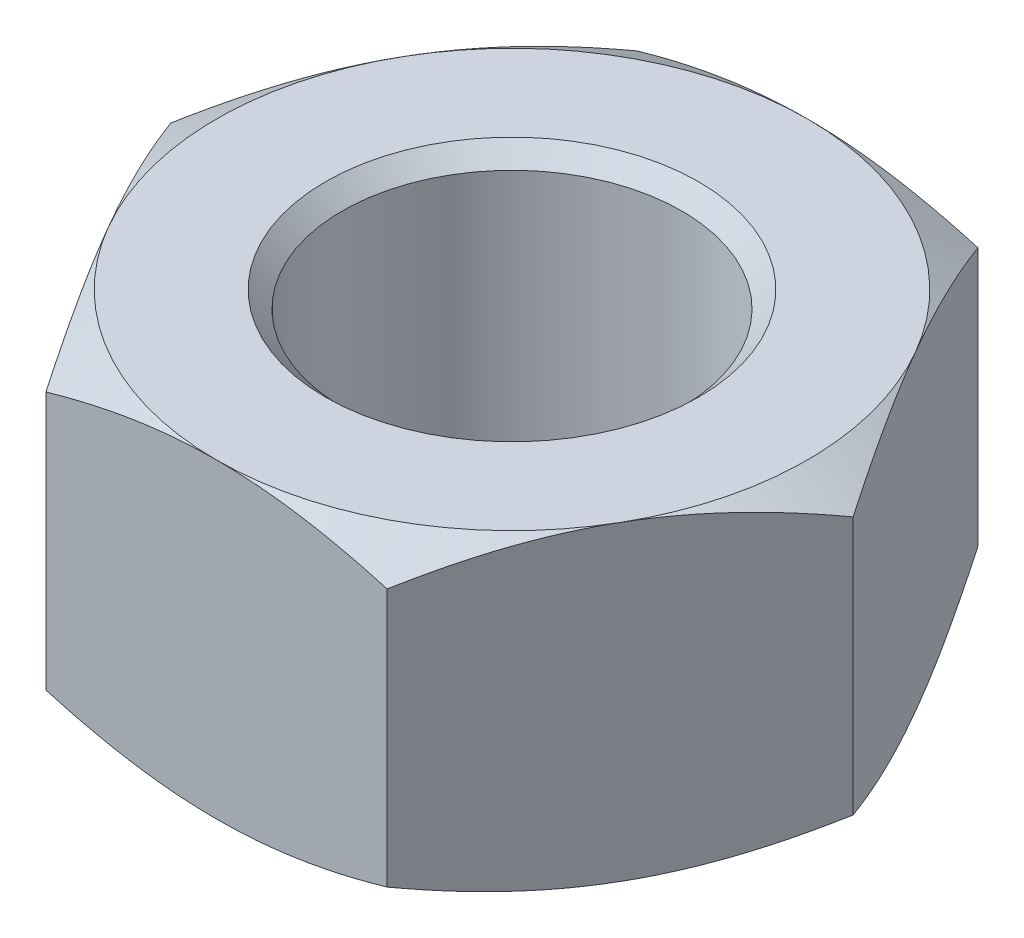
ISO-10303-21;
HEADER;
FILE_DESCRIPTION(('STEP AP214'),'2;1');
FILE_NAME('part.step','',(''),(''),'','','');
FILE_SCHEMA(('AUTOMOTIVE_DESIGN { 1 0 10303 214 1 1 1 1 }'));
ENDSEC;
DATA;
#1=APPLICATION_CONTEXT('core data for automotive mechanical design processes');
#2=APPLICATION_PROTOCOL_DEFINITION('international standard','automotive_design',2000,#1);
#3=PRODUCT_CONTEXT('',#1,'mechanical');
#4=PRODUCT('Part','Part','',(#3));
#5=PRODUCT_RELATED_PRODUCT_CATEGORY('part','',(#4));
#6=PRODUCT_DEFINITION_FORMATION('','',#4);
#7=PRODUCT_DEFINITION_CONTEXT('part definition',#1,'design');
#8=PRODUCT_DEFINITION('design','',#6,#7);
#9=PRODUCT_DEFINITION_SHAPE('','',#8);
#10=(LENGTH_UNIT() NAMED_UNIT(*) SI_UNIT(.MILLI.,.METRE.));
#11=(NAMED_UNIT(*) PLANE_ANGLE_UNIT() SI_UNIT($,.RADIAN.));
#12=(NAMED_UNIT(*) SI_UNIT($,.STERADIAN.) SOLID_ANGLE_UNIT());
#13=UNCERTAINTY_MEASURE_WITH_UNIT(LENGTH_MEASURE(1.E-05),#10,'distance_accuracy_value','');
#14=(GEOMETRIC_REPRESENTATION_CONTEXT(3) GLOBAL_UNCERTAINTY_ASSIGNED_CONTEXT((#13)) GLOBAL_UNIT_ASSIGNED_CONTEXT((#10,
#11,#12)) REPRESENTATION_CONTEXT('',''));
#15=CARTESIAN_POINT('',(0.,0.,0.));
#16=DIRECTION('',(0.,0.,1.));
#17=DIRECTION('',(1.,0.,0.));
#18=AXIS2_PLACEMENT_3D('',#15,#16,#17);
#19=CARTESIAN_POINT('',(-38.7727586640478,-69.,-4.75));
#20=DIRECTION('',(0.866025403784439,0.,-0.5));
#21=DIRECTION('',(-0.5,0.,-0.866025403784439));
#22=AXIS2_PLACEMENT_3D('',#19,#20,#21);
#23=PLANE('',#22);
#24=CARTESIAN_POINT('',(-41.5180162225476,-67.1498517286183,-9.50492557118405));
#25=CARTESIAN_POINT('',(-40.0466600833053,-68.,-6.95646198198795));
#26=CARTESIAN_POINT('',(-38.7727586640478,-68.,-4.75));
#27=CARTESIAN_POINT('',(-37.4988572447905,-68.0000000000001,-2.54353801801205));
#28=CARTESIAN_POINT('',(-36.0275011055481,-67.1498517286183,0.00492557118405202));
#29=(BOUNDED_CURVE() B_SPLINE_CURVE(2,(#24,#25,#26,#27,#28),.UNSPECIFIED.,.F.,
.F.) B_SPLINE_CURVE_WITH_KNOTS((3,2,3),(0.,5.57015057763849,11.140301155277),
.UNSPECIFIED.) CURVE() GEOMETRIC_REPRESENTATION_ITEM() RATIONAL_B_SPLINE_CURVE((1.,
1.03802697460132,1.,1.03802697460132,1.)) REPRESENTATION_ITEM(''));
#30=CARTESIAN_POINT('',(-41.5151724426986,-67.1514942239681,-9.5));
#31=VERTEX_POINT('',#30);
#32=CARTESIAN_POINT('',(-38.7727586640478,-68.,-4.75));
#33=VERTEX_POINT('',#32);
#34=EDGE_CURVE('E137',#31,#33,#29,.T.);
#35=ORIENTED_EDGE('',*,*,#34,.F.);
#36=DIRECTION('',(0.,1.,0.));
#37=VECTOR('',#36,1.);
#38=CARTESIAN_POINT('',(-41.5151724426986,-69.,-9.5));
#39=LINE('',#38,#37);
#40=CARTESIAN_POINT('',(-41.5151724426986,-58.8485057760319,-9.5));
#41=VERTEX_POINT('',#40);
#42=EDGE_CURVE('E10',#31,#41,#39,.T.);
#43=ORIENTED_EDGE('',*,*,#42,.T.);
#44=CARTESIAN_POINT('',(-36.0275011055481,-58.8501482713817,0.00492557118405869));
#45=CARTESIAN_POINT('',(-37.4988572447904,-58.,-2.54353801801204));
#46=CARTESIAN_POINT('',(-38.7727586640478,-58.,-4.75));
#47=CARTESIAN_POINT('',(-40.0466600833052,-58.,-6.95646198198795));
#48=CARTESIAN_POINT('',(-41.5180162225476,-58.8501482713817,-9.50492557118406));
#49=(BOUNDED_CURVE() B_SPLINE_CURVE(2,(#44,#45,#46,#47,#48),.UNSPECIFIED.,.F.,
.F.) B_SPLINE_CURVE_WITH_KNOTS((3,2,3),(0.,5.57015057763849,11.140301155277),
.UNSPECIFIED.) CURVE() GEOMETRIC_REPRESENTATION_ITEM() RATIONAL_B_SPLINE_CURVE((1.,
1.03802697460132,1.,1.03802697460132,1.)) REPRESENTATION_ITEM(''));
#50=CARTESIAN_POINT('',(-38.7727586640478,-58.,-4.75));
#51=VERTEX_POINT('',#50);
#52=EDGE_CURVE('E166',#51,#41,#49,.T.);
#53=ORIENTED_EDGE('',*,*,#52,.F.);
#54=CARTESIAN_POINT('',(-36.0275011055481,-58.8501482713817,0.00492557118405869));
#55=CARTESIAN_POINT('',(-37.4988572447904,-58.,-2.54353801801204));
#56=CARTESIAN_POINT('',(-38.7727586640478,-58.,-4.75));
#57=CARTESIAN_POINT('',(-40.0466600833052,-58.,-6.95646198198795));
#58=CARTESIAN_POINT('',(-41.5180162225476,-58.8501482713817,-9.50492557118406));
#59=(BOUNDED_CURVE() B_SPLINE_CURVE(2,(#54,#55,#56,#57,#58),.UNSPECIFIED.,.F.,
.F.) B_SPLINE_CURVE_WITH_KNOTS((3,2,3),(0.,5.57015057763849,11.140301155277),
.UNSPECIFIED.) CURVE() GEOMETRIC_REPRESENTATION_ITEM() RATIONAL_B_SPLINE_CURVE((1.,
1.03802697460132,1.,1.03802697460132,1.)) REPRESENTATION_ITEM(''));
#60=CARTESIAN_POINT('',(-36.0303448853971,-58.8485057760319,0.));
#61=VERTEX_POINT('',#60);
#62=EDGE_CURVE('E212',#61,#51,#59,.T.);
#63=ORIENTED_EDGE('',*,*,#62,.F.);
#64=DIRECTION('',(0.,1.,0.));
#65=VECTOR('',#64,1.);
#66=CARTESIAN_POINT('',(-36.0303448853971,-69.,0.));
#67=LINE('',#66,#65);
#68=CARTESIAN_POINT('',(-36.0303448853971,-67.1514942239681,0.));
#69=VERTEX_POINT('',#68);
#70=EDGE_CURVE('E231',#69,#61,#67,.T.);
#71=ORIENTED_EDGE('',*,*,#70,.F.);
#72=CARTESIAN_POINT('',(-41.5180162225476,-67.1498517286183,-9.50492557118405));
#73=CARTESIAN_POINT('',(-40.0466600833053,-68.,-6.95646198198795));
#74=CARTESIAN_POINT('',(-38.7727586640478,-68.,-4.75));
#75=CARTESIAN_POINT('',(-37.4988572447905,-68.0000000000001,-2.54353801801205));
#76=CARTESIAN_POINT('',(-36.0275011055481,-67.1498517286183,0.00492557118405202));
#77=(BOUNDED_CURVE() B_SPLINE_CURVE(2,(#72,#73,#74,#75,#76),.UNSPECIFIED.,.F.,
.F.) B_SPLINE_CURVE_WITH_KNOTS((3,2,3),(0.,5.57015057763849,11.140301155277),
.UNSPECIFIED.) CURVE() GEOMETRIC_REPRESENTATION_ITEM() RATIONAL_B_SPLINE_CURVE((1.,
1.03802697460132,1.,1.03802697460132,1.)) REPRESENTATION_ITEM(''));
#78=EDGE_CURVE('E136',#33,#69,#77,.T.);
#79=ORIENTED_EDGE('',*,*,#78,.F.);
#80=EDGE_LOOP('',(#35,#43,#53,#63,#71,#79));
#81=FACE_BOUND('',#80,.T.);
#82=ADVANCED_FACE('F15',(#81),#23,.T.);
#83=CARTESIAN_POINT('',(-47.,-69.,-9.5));
#84=DIRECTION('',(0.,0.,-1.));
#85=DIRECTION('',(-1.,0.,0.));
#86=AXIS2_PLACEMENT_3D('',#83,#84,#85);
#87=PLANE('',#86);
#88=CARTESIAN_POINT('',(-52.4905151169995,-67.1498517286183,-9.5));
#89=CARTESIAN_POINT('',(-49.5478028385149,-68.0000000000001,-9.50000000000001));
#90=CARTESIAN_POINT('',(-47.,-68.,-9.5));
#91=CARTESIAN_POINT('',(-44.4521971614852,-68.0000000000001,-9.50000000000001));
#92=CARTESIAN_POINT('',(-41.5094848830005,-67.1498517286183,-9.5));
#93=(BOUNDED_CURVE() B_SPLINE_CURVE(2,(#88,#89,#90,#91,#92),.UNSPECIFIED.,.F.,
.F.) B_SPLINE_CURVE_WITH_KNOTS((3,2,3),(0.,5.57015057763849,11.140301155277),
.UNSPECIFIED.) CURVE() GEOMETRIC_REPRESENTATION_ITEM() RATIONAL_B_SPLINE_CURVE((1.,
1.03802697460134,1.,1.03802697460134,1.)) REPRESENTATION_ITEM(''));
#94=CARTESIAN_POINT('',(-52.4848275573015,-67.1514942239681,-9.5));
#95=VERTEX_POINT('',#94);
#96=CARTESIAN_POINT('',(-47.,-68.,-9.5));
#97=VERTEX_POINT('',#96);
#98=EDGE_CURVE('E173',#95,#97,#93,.T.);
#99=ORIENTED_EDGE('',*,*,#98,.F.);
#100=DIRECTION('',(0.,1.,0.));
#101=VECTOR('',#100,1.);
#102=CARTESIAN_POINT('',(-52.4848275573015,-69.,-9.5));
#103=LINE('',#102,#101);
#104=CARTESIAN_POINT('',(-52.4848275573015,-58.8485057760319,-9.5));
#105=VERTEX_POINT('',#104);
#106=EDGE_CURVE('E27',#95,#105,#103,.T.);
#107=ORIENTED_EDGE('',*,*,#106,.T.);
#108=CARTESIAN_POINT('',(-41.5094848830005,-58.8501482713817,-9.5));
#109=CARTESIAN_POINT('',(-44.4521971614851,-58.,-9.50000000000001));
#110=CARTESIAN_POINT('',(-47.,-58.,-9.5));
#111=CARTESIAN_POINT('',(-49.5478028385149,-58.,-9.50000000000001));
#112=CARTESIAN_POINT('',(-52.4905151169995,-58.8501482713817,-9.5));
#113=(BOUNDED_CURVE() B_SPLINE_CURVE(2,(#108,#109,#110,#111,#112),.UNSPECIFIED.,.F.,
.F.) B_SPLINE_CURVE_WITH_KNOTS((3,2,3),(0.,5.5701505776385,11.140301155277),
.UNSPECIFIED.) CURVE() GEOMETRIC_REPRESENTATION_ITEM() RATIONAL_B_SPLINE_CURVE((1.,
1.03802697460132,1.,1.03802697460132,1.)) REPRESENTATION_ITEM(''));
#114=CARTESIAN_POINT('',(-47.,-58.,-9.5));
#115=VERTEX_POINT('',#114);
#116=EDGE_CURVE('E138',#115,#105,#113,.T.);
#117=ORIENTED_EDGE('',*,*,#116,.F.);
#118=CARTESIAN_POINT('',(-41.5094848830005,-58.8501482713817,-9.5));
#119=CARTESIAN_POINT('',(-44.4521971614851,-58.,-9.50000000000001));
#120=CARTESIAN_POINT('',(-47.,-58.,-9.5));
#121=CARTESIAN_POINT('',(-49.5478028385149,-58.,-9.50000000000001));
#122=CARTESIAN_POINT('',(-52.4905151169995,-58.8501482713817,-9.5));
#123=(BOUNDED_CURVE() B_SPLINE_CURVE(2,(#118,#119,#120,#121,#122),.UNSPECIFIED.,.F.,
.F.) B_SPLINE_CURVE_WITH_KNOTS((3,2,3),(0.,5.5701505776385,11.140301155277),
.UNSPECIFIED.) CURVE() GEOMETRIC_REPRESENTATION_ITEM() RATIONAL_B_SPLINE_CURVE((1.,
1.03802697460132,1.,1.03802697460132,1.)) REPRESENTATION_ITEM(''));
#124=EDGE_CURVE('E171',#41,#115,#123,.T.);
#125=ORIENTED_EDGE('',*,*,#124,.F.);
#126=ORIENTED_EDGE('',*,*,#42,.F.);
#127=CARTESIAN_POINT('',(-52.4905151169995,-67.1498517286183,-9.5));
#128=CARTESIAN_POINT('',(-49.5478028385149,-68.0000000000001,-9.50000000000001));
#129=CARTESIAN_POINT('',(-47.,-68.,-9.5));
#130=CARTESIAN_POINT('',(-44.4521971614852,-68.0000000000001,-9.50000000000001));
#131=CARTESIAN_POINT('',(-41.5094848830005,-67.1498517286183,-9.5));
#132=(BOUNDED_CURVE() B_SPLINE_CURVE(2,(#127,#128,#129,#130,#131),.UNSPECIFIED.,.F.,
.F.) B_SPLINE_CURVE_WITH_KNOTS((3,2,3),(0.,5.57015057763849,11.140301155277),
.UNSPECIFIED.) CURVE() GEOMETRIC_REPRESENTATION_ITEM() RATIONAL_B_SPLINE_CURVE((1.,
1.03802697460134,1.,1.03802697460134,1.)) REPRESENTATION_ITEM(''));
#133=EDGE_CURVE('E183',#97,#31,#132,.T.);
#134=ORIENTED_EDGE('',*,*,#133,.F.);
#135=EDGE_LOOP('',(#99,#107,#117,#125,#126,#134));
#136=FACE_BOUND('',#135,.T.);
#137=ADVANCED_FACE('F417',(#136),#87,.T.);
#138=CARTESIAN_POINT('',(-55.2272413359522,-69.,-4.75));
#139=DIRECTION('',(-0.866025403784439,0.,-0.5));
#140=DIRECTION('',(-0.5,0.,0.866025403784439));
#141=AXIS2_PLACEMENT_3D('',#138,#139,#140);
#142=PLANE('',#141);
#143=CARTESIAN_POINT('',(-57.9724988944519,-67.1498517286183,0.00492557118405107));
#144=CARTESIAN_POINT('',(-56.5011427552097,-68.0000000000001,-2.54353801801205));
#145=CARTESIAN_POINT('',(-55.2272413359522,-68.,-4.75));
#146=CARTESIAN_POINT('',(-53.9533399166947,-68.,-6.95646198198796));
#147=CARTESIAN_POINT('',(-52.4819837774524,-67.1498517286183,-9.50492557118406));
#148=(BOUNDED_CURVE() B_SPLINE_CURVE(2,(#143,#144,#145,#146,#147),.UNSPECIFIED.,.F.,
.F.) B_SPLINE_CURVE_WITH_KNOTS((3,2,3),(0.,5.57015057763849,11.140301155277),
.UNSPECIFIED.) CURVE() GEOMETRIC_REPRESENTATION_ITEM() RATIONAL_B_SPLINE_CURVE((1.,
1.03802697460134,1.,1.03802697460135,1.)) REPRESENTATION_ITEM(''));
#149=CARTESIAN_POINT('',(-57.9696551146029,-67.1514942239681,0.));
#150=VERTEX_POINT('',#149);
#151=CARTESIAN_POINT('',(-55.2272413359522,-68.,-4.75));
#152=VERTEX_POINT('',#151);
#153=EDGE_CURVE('E114',#150,#152,#148,.T.);
#154=ORIENTED_EDGE('',*,*,#153,.F.);
#155=DIRECTION('',(0.,1.,0.));
#156=VECTOR('',#155,1.);
#157=CARTESIAN_POINT('',(-57.9696551146029,-69.,0.));
#158=LINE('',#157,#156);
#159=CARTESIAN_POINT('',(-57.9696551146029,-58.8485057760319,0.));
#160=VERTEX_POINT('',#159);
#161=EDGE_CURVE('E105',#150,#160,#158,.T.);
#162=ORIENTED_EDGE('',*,*,#161,.T.);
#163=CARTESIAN_POINT('',(-52.4819837774524,-58.8501482713817,-9.50492557118407));
#164=CARTESIAN_POINT('',(-53.9533399166948,-58.,-6.95646198198798));
#165=CARTESIAN_POINT('',(-55.2272413359522,-58.,-4.75));
#166=CARTESIAN_POINT('',(-56.5011427552097,-58.,-2.54353801801203));
#167=CARTESIAN_POINT('',(-57.9724988944519,-58.8501482713817,0.00492557118405964));
#168=(BOUNDED_CURVE() B_SPLINE_CURVE(2,(#163,#164,#165,#166,#167),.UNSPECIFIED.,.F.,
.F.) B_SPLINE_CURVE_WITH_KNOTS((3,2,3),(0.,5.5701505776385,11.140301155277),
.UNSPECIFIED.) CURVE() GEOMETRIC_REPRESENTATION_ITEM() RATIONAL_B_SPLINE_CURVE((1.,
1.03802697460132,1.,1.03802697460132,1.)) REPRESENTATION_ITEM(''));
#169=CARTESIAN_POINT('',(-55.2272413359522,-58.,-4.75));
#170=VERTEX_POINT('',#169);
#171=EDGE_CURVE('E153',#170,#160,#168,.T.);
#172=ORIENTED_EDGE('',*,*,#171,.F.);
#173=CARTESIAN_POINT('',(-52.4819837774524,-58.8501482713817,-9.50492557118407));
#174=CARTESIAN_POINT('',(-53.9533399166948,-58.,-6.95646198198798));
#175=CARTESIAN_POINT('',(-55.2272413359522,-58.,-4.75));
#176=CARTESIAN_POINT('',(-56.5011427552097,-58.,-2.54353801801203));
#177=CARTESIAN_POINT('',(-57.9724988944519,-58.8501482713817,0.00492557118405964));
#178=(BOUNDED_CURVE() B_SPLINE_CURVE(2,(#173,#174,#175,#176,#177),.UNSPECIFIED.,.F.,
.F.) B_SPLINE_CURVE_WITH_KNOTS((3,2,3),(0.,5.5701505776385,11.140301155277),
.UNSPECIFIED.) CURVE() GEOMETRIC_REPRESENTATION_ITEM() RATIONAL_B_SPLINE_CURVE((1.,
1.03802697460132,1.,1.03802697460132,1.)) REPRESENTATION_ITEM(''));
#179=EDGE_CURVE('E330',#105,#170,#178,.T.);
#180=ORIENTED_EDGE('',*,*,#179,.F.);
#181=ORIENTED_EDGE('',*,*,#106,.F.);
#182=CARTESIAN_POINT('',(-57.9724988944519,-67.1498517286183,0.00492557118405107));
#183=CARTESIAN_POINT('',(-56.5011427552097,-68.0000000000001,-2.54353801801205));
#184=CARTESIAN_POINT('',(-55.2272413359522,-68.,-4.75));
#185=CARTESIAN_POINT('',(-53.9533399166947,-68.,-6.95646198198796));
#186=CARTESIAN_POINT('',(-52.4819837774524,-67.1498517286183,-9.50492557118406));
#187=(BOUNDED_CURVE() B_SPLINE_CURVE(2,(#182,#183,#184,#185,#186),.UNSPECIFIED.,.F.,
.F.) B_SPLINE_CURVE_WITH_KNOTS((3,2,3),(0.,5.57015057763849,11.140301155277),
.UNSPECIFIED.) CURVE() GEOMETRIC_REPRESENTATION_ITEM() RATIONAL_B_SPLINE_CURVE((1.,
1.03802697460134,1.,1.03802697460135,1.)) REPRESENTATION_ITEM(''));
#188=EDGE_CURVE('E182',#152,#95,#187,.T.);
#189=ORIENTED_EDGE('',*,*,#188,.F.);
#190=EDGE_LOOP('',(#154,#162,#172,#180,#181,#189));
#191=FACE_BOUND('',#190,.T.);
#192=ADVANCED_FACE('F245',(#191),#142,.T.);
#193=CARTESIAN_POINT('',(-38.7727586640478,-69.,4.75));
#194=DIRECTION('',(0.866025403784439,0.,0.5));
#195=DIRECTION('',(0.5,0.,-0.866025403784439));
#196=AXIS2_PLACEMENT_3D('',#193,#194,#195);
#197=PLANE('',#196);
#198=CARTESIAN_POINT('',(-36.0275011055481,-67.1498517286183,-0.00492557118405583));
#199=CARTESIAN_POINT('',(-37.4988572447904,-68.,2.54353801801203));
#200=CARTESIAN_POINT('',(-38.7727586640478,-68.,4.75));
#201=CARTESIAN_POINT('',(-40.0466600833052,-67.9999999999999,6.95646198198796));
#202=CARTESIAN_POINT('',(-41.5180162225476,-67.1498517286183,9.50492557118405));
#203=(BOUNDED_CURVE() B_SPLINE_CURVE(2,(#198,#199,#200,#201,#202),.UNSPECIFIED.,.F.,
.F.) B_SPLINE_CURVE_WITH_KNOTS((3,2,3),(0.,5.57015057763849,11.140301155277),
.UNSPECIFIED.) CURVE() GEOMETRIC_REPRESENTATION_ITEM() RATIONAL_B_SPLINE_CURVE((1.,
1.03802697460133,1.,1.03802697460135,1.)) REPRESENTATION_ITEM(''));
#204=CARTESIAN_POINT('',(-38.7727586640478,-68.,4.75));
#205=VERTEX_POINT('',#204);
#206=CARTESIAN_POINT('',(-41.5151724426986,-67.1514942239681,9.5));
#207=VERTEX_POINT('',#206);
#208=EDGE_CURVE('E121',#205,#207,#203,.T.);
#209=ORIENTED_EDGE('',*,*,#208,.F.);
#210=CARTESIAN_POINT('',(-36.0275011055481,-67.1498517286183,-0.00492557118405583));
#211=CARTESIAN_POINT('',(-37.4988572447904,-68.,2.54353801801203));
#212=CARTESIAN_POINT('',(-38.7727586640478,-68.,4.75));
#213=CARTESIAN_POINT('',(-40.0466600833052,-67.9999999999999,6.95646198198796));
#214=CARTESIAN_POINT('',(-41.5180162225476,-67.1498517286183,9.50492557118405));
#215=(BOUNDED_CURVE() B_SPLINE_CURVE(2,(#210,#211,#212,#213,#214),.UNSPECIFIED.,.F.,
.F.) B_SPLINE_CURVE_WITH_KNOTS((3,2,3),(0.,5.57015057763849,11.140301155277),
.UNSPECIFIED.) CURVE() GEOMETRIC_REPRESENTATION_ITEM() RATIONAL_B_SPLINE_CURVE((1.,
1.03802697460133,1.,1.03802697460135,1.)) REPRESENTATION_ITEM(''));
#216=EDGE_CURVE('E19',#69,#205,#215,.T.);
#217=ORIENTED_EDGE('',*,*,#216,.F.);
#218=ORIENTED_EDGE('',*,*,#70,.T.);
#219=CARTESIAN_POINT('',(-41.5180162225476,-58.8501482713817,9.50492557118406));
#220=CARTESIAN_POINT('',(-40.0466600833053,-58.,6.95646198198797));
#221=CARTESIAN_POINT('',(-38.7727586640478,-58.,4.75));
#222=CARTESIAN_POINT('',(-37.4988572447904,-58.,2.54353801801203));
#223=CARTESIAN_POINT('',(-36.0275011055481,-58.8501482713817,-0.00492557118406345));
#224=(BOUNDED_CURVE() B_SPLINE_CURVE(2,(#219,#220,#221,#222,#223),.UNSPECIFIED.,.F.,
.F.) B_SPLINE_CURVE_WITH_KNOTS((3,2,3),(0.,5.5701505776385,11.140301155277),
.UNSPECIFIED.) CURVE() GEOMETRIC_REPRESENTATION_ITEM() RATIONAL_B_SPLINE_CURVE((1.,
1.03802697460133,1.,1.03802697460134,1.)) REPRESENTATION_ITEM(''));
#225=CARTESIAN_POINT('',(-38.7727586640478,-58.,4.75));
#226=VERTEX_POINT('',#225);
#227=EDGE_CURVE('E283',#226,#61,#224,.T.);
#228=ORIENTED_EDGE('',*,*,#227,.F.);
#229=CARTESIAN_POINT('',(-41.5180162225476,-58.8501482713817,9.50492557118406));
#230=CARTESIAN_POINT('',(-40.0466600833053,-58.,6.95646198198797));
#231=CARTESIAN_POINT('',(-38.7727586640478,-58.,4.75));
#232=CARTESIAN_POINT('',(-37.4988572447904,-58.,2.54353801801203));
#233=CARTESIAN_POINT('',(-36.0275011055481,-58.8501482713817,-0.00492557118406345));
#234=(BOUNDED_CURVE() B_SPLINE_CURVE(2,(#229,#230,#231,#232,#233),.UNSPECIFIED.,.F.,
.F.) B_SPLINE_CURVE_WITH_KNOTS((3,2,3),(0.,5.5701505776385,11.140301155277),
.UNSPECIFIED.) CURVE() GEOMETRIC_REPRESENTATION_ITEM() RATIONAL_B_SPLINE_CURVE((1.,
1.03802697460133,1.,1.03802697460134,1.)) REPRESENTATION_ITEM(''));
#235=CARTESIAN_POINT('',(-41.5151724426986,-58.8485057760319,9.5));
#236=VERTEX_POINT('',#235);
#237=EDGE_CURVE('E299',#236,#226,#234,.T.);
#238=ORIENTED_EDGE('',*,*,#237,.F.);
#239=DIRECTION('',(0.,1.,0.));
#240=VECTOR('',#239,1.);
#241=CARTESIAN_POINT('',(-41.5151724426986,-69.,9.5));
#242=LINE('',#241,#240);
#243=EDGE_CURVE('E296',#207,#236,#242,.T.);
#244=ORIENTED_EDGE('',*,*,#243,.F.);
#245=EDGE_LOOP('',(#209,#217,#218,#228,#238,#244));
#246=FACE_BOUND('',#245,.T.);
#247=ADVANCED_FACE('F17',(#246),#197,.T.);
#248=CARTESIAN_POINT('',(-47.,-69.,9.5));
#249=DIRECTION('',(0.,0.,1.));
#250=DIRECTION('',(1.,0.,0.));
#251=AXIS2_PLACEMENT_3D('',#248,#249,#250);
#252=PLANE('',#251);
#253=CARTESIAN_POINT('',(-41.5094848830005,-67.1498517286183,9.5));
#254=CARTESIAN_POINT('',(-44.4521971614851,-68.0000000000001,9.5));
#255=CARTESIAN_POINT('',(-47.,-68.,9.5));
#256=CARTESIAN_POINT('',(-49.5478028385148,-68.,9.49999999999999));
#257=CARTESIAN_POINT('',(-52.4905151169995,-67.1498517286183,9.5));
#258=(BOUNDED_CURVE() B_SPLINE_CURVE(2,(#253,#254,#255,#256,#257),.UNSPECIFIED.,.F.,
.F.) B_SPLINE_CURVE_WITH_KNOTS((3,2,3),(0.,5.5701505776385,11.140301155277),
.UNSPECIFIED.) CURVE() GEOMETRIC_REPRESENTATION_ITEM() RATIONAL_B_SPLINE_CURVE((1.,
1.03802697460134,1.,1.03802697460134,1.)) REPRESENTATION_ITEM(''));
#259=CARTESIAN_POINT('',(-47.,-68.,9.5));
#260=VERTEX_POINT('',#259);
#261=CARTESIAN_POINT('',(-52.4848275573015,-67.1514942239681,9.5));
#262=VERTEX_POINT('',#261);
#263=EDGE_CURVE('E97',#260,#262,#258,.T.);
#264=ORIENTED_EDGE('',*,*,#263,.F.);
#265=CARTESIAN_POINT('',(-41.5094848830005,-67.1498517286183,9.5));
#266=CARTESIAN_POINT('',(-44.4521971614851,-68.0000000000001,9.5));
#267=CARTESIAN_POINT('',(-47.,-68.,9.5));
#268=CARTESIAN_POINT('',(-49.5478028385148,-68.,9.49999999999999));
#269=CARTESIAN_POINT('',(-52.4905151169995,-67.1498517286183,9.5));
#270=(BOUNDED_CURVE() B_SPLINE_CURVE(2,(#265,#266,#267,#268,#269),.UNSPECIFIED.,.F.,
.F.) B_SPLINE_CURVE_WITH_KNOTS((3,2,3),(0.,5.5701505776385,11.140301155277),
.UNSPECIFIED.) CURVE() GEOMETRIC_REPRESENTATION_ITEM() RATIONAL_B_SPLINE_CURVE((1.,
1.03802697460134,1.,1.03802697460134,1.)) REPRESENTATION_ITEM(''));
#271=EDGE_CURVE('E325',#207,#260,#270,.T.);
#272=ORIENTED_EDGE('',*,*,#271,.F.);
#273=ORIENTED_EDGE('',*,*,#243,.T.);
#274=CARTESIAN_POINT('',(-52.4905151169995,-58.8501482713817,9.5));
#275=CARTESIAN_POINT('',(-49.5478028385149,-58.,9.5));
#276=CARTESIAN_POINT('',(-47.,-58.,9.5));
#277=CARTESIAN_POINT('',(-44.4521971614851,-57.9999999999999,9.5));
#278=CARTESIAN_POINT('',(-41.5094848830005,-58.8501482713817,9.5));
#279=(BOUNDED_CURVE() B_SPLINE_CURVE(2,(#274,#275,#276,#277,#278),.UNSPECIFIED.,.F.,
.F.) B_SPLINE_CURVE_WITH_KNOTS((3,2,3),(0.,5.5701505776385,11.140301155277),
.UNSPECIFIED.) CURVE() GEOMETRIC_REPRESENTATION_ITEM() RATIONAL_B_SPLINE_CURVE((1.,
1.03802697460136,1.,1.03802697460136,1.)) REPRESENTATION_ITEM(''));
#280=CARTESIAN_POINT('',(-47.,-58.,9.5));
#281=VERTEX_POINT('',#280);
#282=EDGE_CURVE('E217',#281,#236,#279,.T.);
#283=ORIENTED_EDGE('',*,*,#282,.F.);
#284=CARTESIAN_POINT('',(-52.4905151169995,-58.8501482713817,9.5));
#285=CARTESIAN_POINT('',(-49.5478028385149,-58.,9.5));
#286=CARTESIAN_POINT('',(-47.,-58.,9.5));
#287=CARTESIAN_POINT('',(-44.4521971614851,-57.9999999999999,9.5));
#288=CARTESIAN_POINT('',(-41.5094848830005,-58.8501482713817,9.5));
#289=(BOUNDED_CURVE() B_SPLINE_CURVE(2,(#284,#285,#286,#287,#288),.UNSPECIFIED.,.F.,
.F.) B_SPLINE_CURVE_WITH_KNOTS((3,2,3),(0.,5.5701505776385,11.140301155277),
.UNSPECIFIED.) CURVE() GEOMETRIC_REPRESENTATION_ITEM() RATIONAL_B_SPLINE_CURVE((1.,
1.03802697460136,1.,1.03802697460136,1.)) REPRESENTATION_ITEM(''));
#290=CARTESIAN_POINT('',(-52.4848275573015,-58.8485057760319,9.5));
#291=VERTEX_POINT('',#290);
#292=EDGE_CURVE('E101',#291,#281,#289,.T.);
#293=ORIENTED_EDGE('',*,*,#292,.F.);
#294=DIRECTION('',(0.,1.,0.));
#295=VECTOR('',#294,1.);
#296=CARTESIAN_POINT('',(-52.4848275573015,-69.,9.5));
#297=LINE('',#296,#295);
#298=EDGE_CURVE('E93',#262,#291,#297,.T.);
#299=ORIENTED_EDGE('',*,*,#298,.F.);
#300=EDGE_LOOP('',(#264,#272,#273,#283,#293,#299));
#301=FACE_BOUND('',#300,.T.);
#302=ADVANCED_FACE('F95',(#301),#252,.T.);
#303=CARTESIAN_POINT('',(-55.2272413359522,-69.,4.75));
#304=DIRECTION('',(-0.866025403784439,0.,0.5));
#305=DIRECTION('',(0.5,0.,0.866025403784439));
#306=AXIS2_PLACEMENT_3D('',#303,#304,#305);
#307=PLANE('',#306);
#308=CARTESIAN_POINT('',(-52.4819837774524,-67.1498517286183,9.50492557118405));
#309=CARTESIAN_POINT('',(-53.9533399166948,-68.,6.95646198198795));
#310=CARTESIAN_POINT('',(-55.2272413359522,-68.,4.75));
#311=CARTESIAN_POINT('',(-56.5011427552096,-68.,2.54353801801204));
#312=CARTESIAN_POINT('',(-57.9724988944519,-67.1498517286183,-0.00492557118405964));
#313=(BOUNDED_CURVE() B_SPLINE_CURVE(2,(#308,#309,#310,#311,#312),.UNSPECIFIED.,.F.,
.F.) B_SPLINE_CURVE_WITH_KNOTS((3,2,3),(0.,5.57015057763849,11.140301155277),
.UNSPECIFIED.) CURVE() GEOMETRIC_REPRESENTATION_ITEM() RATIONAL_B_SPLINE_CURVE((1.,
1.03802697460133,1.,1.03802697460134,1.)) REPRESENTATION_ITEM(''));
#314=CARTESIAN_POINT('',(-55.2272413359522,-68.,4.75));
#315=VERTEX_POINT('',#314);
#316=EDGE_CURVE('E119',#315,#150,#313,.T.);
#317=ORIENTED_EDGE('',*,*,#316,.F.);
#318=CARTESIAN_POINT('',(-52.4819837774524,-67.1498517286183,9.50492557118405));
#319=CARTESIAN_POINT('',(-53.9533399166948,-68.,6.95646198198795));
#320=CARTESIAN_POINT('',(-55.2272413359522,-68.,4.75));
#321=CARTESIAN_POINT('',(-56.5011427552096,-68.,2.54353801801204));
#322=CARTESIAN_POINT('',(-57.9724988944519,-67.1498517286183,-0.00492557118405964));
#323=(BOUNDED_CURVE() B_SPLINE_CURVE(2,(#318,#319,#320,#321,#322),.UNSPECIFIED.,.F.,
.F.) B_SPLINE_CURVE_WITH_KNOTS((3,2,3),(0.,5.57015057763849,11.140301155277),
.UNSPECIFIED.) CURVE() GEOMETRIC_REPRESENTATION_ITEM() RATIONAL_B_SPLINE_CURVE((1.,
1.03802697460133,1.,1.03802697460134,1.)) REPRESENTATION_ITEM(''));
#324=EDGE_CURVE('E110',#262,#315,#323,.T.);
#325=ORIENTED_EDGE('',*,*,#324,.F.);
#326=ORIENTED_EDGE('',*,*,#298,.T.);
#327=CARTESIAN_POINT('',(-57.9724988944519,-58.8501482713817,-0.00492557118406345));
#328=CARTESIAN_POINT('',(-56.5011427552095,-58.,2.54353801801203));
#329=CARTESIAN_POINT('',(-55.2272413359522,-58.,4.75));
#330=CARTESIAN_POINT('',(-53.9533399166947,-58.,6.95646198198796));
#331=CARTESIAN_POINT('',(-52.4819837774524,-58.8501482713817,9.50492557118406));
#332=(BOUNDED_CURVE() B_SPLINE_CURVE(2,(#327,#328,#329,#330,#331),.UNSPECIFIED.,.F.,
.F.) B_SPLINE_CURVE_WITH_KNOTS((3,2,3),(0.,5.57015057763849,11.140301155277),
.UNSPECIFIED.) CURVE() GEOMETRIC_REPRESENTATION_ITEM() RATIONAL_B_SPLINE_CURVE((1.,
1.03802697460132,1.,1.03802697460134,1.)) REPRESENTATION_ITEM(''));
#333=CARTESIAN_POINT('',(-55.2272413359522,-58.,4.75));
#334=VERTEX_POINT('',#333);
#335=EDGE_CURVE('E213',#334,#291,#332,.T.);
#336=ORIENTED_EDGE('',*,*,#335,.F.);
#337=CARTESIAN_POINT('',(-57.9724988944519,-58.8501482713817,-0.00492557118406345));
#338=CARTESIAN_POINT('',(-56.5011427552095,-58.,2.54353801801203));
#339=CARTESIAN_POINT('',(-55.2272413359522,-58.,4.75));
#340=CARTESIAN_POINT('',(-53.9533399166947,-58.,6.95646198198796));
#341=CARTESIAN_POINT('',(-52.4819837774524,-58.8501482713817,9.50492557118406));
#342=(BOUNDED_CURVE() B_SPLINE_CURVE(2,(#337,#338,#339,#340,#341),.UNSPECIFIED.,.F.,
.F.) B_SPLINE_CURVE_WITH_KNOTS((3,2,3),(0.,5.57015057763849,11.140301155277),
.UNSPECIFIED.) CURVE() GEOMETRIC_REPRESENTATION_ITEM() RATIONAL_B_SPLINE_CURVE((1.,
1.03802697460132,1.,1.03802697460134,1.)) REPRESENTATION_ITEM(''));
#343=EDGE_CURVE('E143',#160,#334,#342,.T.);
#344=ORIENTED_EDGE('',*,*,#343,.F.);
#345=ORIENTED_EDGE('',*,*,#161,.F.);
#346=EDGE_LOOP('',(#317,#325,#326,#336,#344,#345));
#347=FACE_BOUND('',#346,.T.);
#348=ADVANCED_FACE('F116',(#347),#307,.T.);
#349=CARTESIAN_POINT('',(-39.25,-68.,0.));
#350=DIRECTION('',(0.,-1.,0.));
#351=DIRECTION('',(-1.,0.,0.));
#352=AXIS2_PLACEMENT_3D('',#349,#350,#351);
#353=PLANE('',#352);
#354=CARTESIAN_POINT('',(-47.,-68.,0.));
#355=DIRECTION('',(0.,1.,0.));
#356=DIRECTION('',(1.,0.,0.));
#357=AXIS2_PLACEMENT_3D('',#354,#355,#356);
#358=CIRCLE('',#357,6.);
#359=CARTESIAN_POINT('',(-41.,-68.,0.));
#360=VERTEX_POINT('',#359);
#361=EDGE_CURVE('E33',#360,#360,#358,.T.);
#362=ORIENTED_EDGE('',*,*,#361,.T.);
#363=EDGE_LOOP('',(#362));
#364=FACE_BOUND('',#363,.T.);
#365=CARTESIAN_POINT('',(-47.,-68.,0.));
#366=DIRECTION('',(0.,1.,0.));
#367=DIRECTION('',(1.,0.,0.));
#368=AXIS2_PLACEMENT_3D('',#365,#366,#367);
#369=CIRCLE('',#368,9.5);
#370=EDGE_CURVE('E257',#205,#33,#369,.T.);
#371=ORIENTED_EDGE('',*,*,#370,.F.);
#372=CARTESIAN_POINT('',(-47.,-68.,0.));
#373=DIRECTION('',(0.,1.,0.));
#374=DIRECTION('',(1.,0.,0.));
#375=AXIS2_PLACEMENT_3D('',#372,#373,#374);
#376=CIRCLE('',#375,9.5);
#377=EDGE_CURVE('E125',#260,#205,#376,.T.);
#378=ORIENTED_EDGE('',*,*,#377,.F.);
#379=CARTESIAN_POINT('',(-47.,-68.,0.));
#380=DIRECTION('',(0.,1.,0.));
#381=DIRECTION('',(1.,0.,0.));
#382=AXIS2_PLACEMENT_3D('',#379,#380,#381);
#383=CIRCLE('',#382,9.5);
#384=EDGE_CURVE('E112',#315,#260,#383,.T.);
#385=ORIENTED_EDGE('',*,*,#384,.F.);
#386=CARTESIAN_POINT('',(-47.,-68.,0.));
#387=DIRECTION('',(0.,1.,0.));
#388=DIRECTION('',(1.,0.,0.));
#389=AXIS2_PLACEMENT_3D('',#386,#387,#388);
#390=CIRCLE('',#389,9.5);
#391=EDGE_CURVE('E198',#152,#315,#390,.T.);
#392=ORIENTED_EDGE('',*,*,#391,.F.);
#393=CARTESIAN_POINT('',(-47.,-68.,0.));
#394=DIRECTION('',(0.,1.,0.));
#395=DIRECTION('',(1.,0.,0.));
#396=AXIS2_PLACEMENT_3D('',#393,#394,#395);
#397=CIRCLE('',#396,9.5);
#398=EDGE_CURVE('E181',#97,#152,#397,.T.);
#399=ORIENTED_EDGE('',*,*,#398,.F.);
#400=CARTESIAN_POINT('',(-47.,-68.,0.));
#401=DIRECTION('',(0.,1.,0.));
#402=DIRECTION('',(1.,0.,0.));
#403=AXIS2_PLACEMENT_3D('',#400,#401,#402);
#404=CIRCLE('',#403,9.5);
#405=EDGE_CURVE('E131',#33,#97,#404,.T.);
#406=ORIENTED_EDGE('',*,*,#405,.F.);
#407=EDGE_LOOP('',(#371,#378,#385,#392,#399,#406));
#408=FACE_BOUND('',#407,.T.);
#409=ADVANCED_FACE('F250',(#364,#408),#353,.T.);
#410=CARTESIAN_POINT('',(-47.,-67.729375,0.));
#411=DIRECTION('',(0.,-1.,0.));
#412=DIRECTION('',(1.,0.,0.));
#413=AXIS2_PLACEMENT_3D('',#410,#411,#412);
#414=CONICAL_SURFACE('',#413,5.729375,0.785398163397448);
#415=CARTESIAN_POINT('',(-47.,-67.45875,0.));
#416=DIRECTION('',(0.,1.,0.));
#417=DIRECTION('',(1.,0.,0.));
#418=AXIS2_PLACEMENT_3D('',#415,#416,#417);
#419=CIRCLE('',#418,5.45875);
#420=CARTESIAN_POINT('',(-41.54125,-67.45875,0.));
#421=VERTEX_POINT('',#420);
#422=EDGE_CURVE('E164',#421,#421,#419,.T.);
#423=ORIENTED_EDGE('',*,*,#422,.T.);
#424=EDGE_LOOP('',(#423));
#425=FACE_BOUND('',#424,.T.);
#426=ORIENTED_EDGE('',*,*,#361,.F.);
#427=EDGE_LOOP('',(#426));
#428=FACE_BOUND('',#427,.T.);
#429=ADVANCED_FACE('F426',(#425,#428),#414,.F.);
#430=CARTESIAN_POINT('',(-47.,-63.,0.));
#431=DIRECTION('',(0.,-1.,0.));
#432=DIRECTION('',(1.,0.,0.));
#433=AXIS2_PLACEMENT_3D('',#430,#431,#432);
#434=CYLINDRICAL_SURFACE('',#433,5.45875);
#435=CARTESIAN_POINT('',(-47.,-58.54125,0.));
#436=DIRECTION('',(0.,1.,0.));
#437=DIRECTION('',(1.,0.,0.));
#438=AXIS2_PLACEMENT_3D('',#435,#436,#437);
#439=CIRCLE('',#438,5.45875);
#440=CARTESIAN_POINT('',(-41.54125,-58.54125,0.));
#441=VERTEX_POINT('',#440);
#442=EDGE_CURVE('E268',#441,#441,#439,.T.);
#443=ORIENTED_EDGE('',*,*,#442,.T.);
#444=EDGE_LOOP('',(#443));
#445=FACE_BOUND('',#444,.T.);
#446=ORIENTED_EDGE('',*,*,#422,.F.);
#447=EDGE_LOOP('',(#446));
#448=FACE_BOUND('',#447,.T.);
#449=ADVANCED_FACE('F430',(#445,#448),#434,.F.);
#450=CARTESIAN_POINT('',(-47.,-58.270625,0.));
#451=DIRECTION('',(0.,1.,0.));
#452=DIRECTION('',(1.,0.,0.));
#453=AXIS2_PLACEMENT_3D('',#450,#451,#452);
#454=CONICAL_SURFACE('',#453,5.729375,0.785398163397448);
#455=CARTESIAN_POINT('',(-47.,-58.,0.));
#456=DIRECTION('',(0.,1.,0.));
#457=DIRECTION('',(1.,0.,0.));
#458=AXIS2_PLACEMENT_3D('',#455,#456,#457);
#459=CIRCLE('',#458,6.);
#460=CARTESIAN_POINT('',(-41.,-58.,0.));
#461=VERTEX_POINT('',#460);
#462=EDGE_CURVE('E271',#461,#461,#459,.T.);
#463=ORIENTED_EDGE('',*,*,#462,.T.);
#464=EDGE_LOOP('',(#463));
#465=FACE_BOUND('',#464,.T.);
#466=ORIENTED_EDGE('',*,*,#442,.F.);
#467=EDGE_LOOP('',(#466));
#468=FACE_BOUND('',#467,.T.);
#469=ADVANCED_FACE('F460',(#465,#468),#454,.F.);
#470=CARTESIAN_POINT('',(-39.25,-58.,0.));
#471=DIRECTION('',(0.,1.,0.));
#472=DIRECTION('',(1.,0.,0.));
#473=AXIS2_PLACEMENT_3D('',#470,#471,#472);
#474=PLANE('',#473);
#475=CARTESIAN_POINT('',(-47.,-58.,0.));
#476=DIRECTION('',(0.,1.,0.));
#477=DIRECTION('',(1.,0.,0.));
#478=AXIS2_PLACEMENT_3D('',#475,#476,#477);
#479=CIRCLE('',#478,9.5);
#480=EDGE_CURVE('E172',#226,#51,#479,.T.);
#481=ORIENTED_EDGE('',*,*,#480,.T.);
#482=CARTESIAN_POINT('',(-47.,-58.,0.));
#483=DIRECTION('',(0.,1.,0.));
#484=DIRECTION('',(1.,0.,0.));
#485=AXIS2_PLACEMENT_3D('',#482,#483,#484);
#486=CIRCLE('',#485,9.5);
#487=EDGE_CURVE('E225',#51,#115,#486,.T.);
#488=ORIENTED_EDGE('',*,*,#487,.T.);
#489=CARTESIAN_POINT('',(-47.,-58.,0.));
#490=DIRECTION('',(0.,1.,0.));
#491=DIRECTION('',(1.,0.,0.));
#492=AXIS2_PLACEMENT_3D('',#489,#490,#491);
#493=CIRCLE('',#492,9.5);
#494=EDGE_CURVE('E144',#115,#170,#493,.T.);
#495=ORIENTED_EDGE('',*,*,#494,.T.);
#496=CARTESIAN_POINT('',(-47.,-58.,0.));
#497=DIRECTION('',(0.,1.,0.));
#498=DIRECTION('',(1.,0.,0.));
#499=AXIS2_PLACEMENT_3D('',#496,#497,#498);
#500=CIRCLE('',#499,9.5);
#501=EDGE_CURVE('E152',#170,#334,#500,.T.);
#502=ORIENTED_EDGE('',*,*,#501,.T.);
#503=CARTESIAN_POINT('',(-47.,-58.,0.));
#504=DIRECTION('',(0.,1.,0.));
#505=DIRECTION('',(1.,0.,0.));
#506=AXIS2_PLACEMENT_3D('',#503,#504,#505);
#507=CIRCLE('',#506,9.5);
#508=EDGE_CURVE('E197',#334,#281,#507,.T.);
#509=ORIENTED_EDGE('',*,*,#508,.T.);
#510=CARTESIAN_POINT('',(-47.,-58.,0.));
#511=DIRECTION('',(0.,1.,0.));
#512=DIRECTION('',(1.,0.,0.));
#513=AXIS2_PLACEMENT_3D('',#510,#511,#512);
#514=CIRCLE('',#513,9.5);
#515=EDGE_CURVE('E291',#281,#226,#514,.T.);
#516=ORIENTED_EDGE('',*,*,#515,.T.);
#517=EDGE_LOOP('',(#481,#488,#495,#502,#509,#516));
#518=FACE_BOUND('',#517,.T.);
#519=ORIENTED_EDGE('',*,*,#462,.F.);
#520=EDGE_LOOP('',(#519));
#521=FACE_BOUND('',#520,.T.);
#522=ADVANCED_FACE('F388',(#518,#521),#474,.T.);
#523=CARTESIAN_POINT('',(-47.,-58.4250741356909,0.));
#524=DIRECTION('',(0.,-1.,0.));
#525=DIRECTION('',(1.,0.,0.));
#526=AXIS2_PLACEMENT_3D('',#523,#524,#525);
#527=CONICAL_SURFACE('',#526,10.23625,1.0471975511966);
#528=ORIENTED_EDGE('',*,*,#52,.T.);
#529=ORIENTED_EDGE('',*,*,#124,.T.);
#530=ORIENTED_EDGE('',*,*,#487,.F.);
#531=EDGE_LOOP('',(#528,#529,#530));
#532=FACE_BOUND('',#531,.T.);
#533=ADVANCED_FACE('F401',(#532),#527,.T.);
#534=CARTESIAN_POINT('',(-47.,-58.4250741356909,0.));
#535=DIRECTION('',(0.,-1.,0.));
#536=DIRECTION('',(1.,0.,0.));
#537=AXIS2_PLACEMENT_3D('',#534,#535,#536);
#538=CONICAL_SURFACE('',#537,10.23625,1.0471975511966);
#539=ORIENTED_EDGE('',*,*,#227,.T.);
#540=ORIENTED_EDGE('',*,*,#62,.T.);
#541=ORIENTED_EDGE('',*,*,#480,.F.);
#542=EDGE_LOOP('',(#539,#540,#541));
#543=FACE_BOUND('',#542,.T.);
#544=ADVANCED_FACE('F405',(#543),#538,.T.);
#545=CARTESIAN_POINT('',(-47.,-58.4250741356909,0.));
#546=DIRECTION('',(0.,-1.,0.));
#547=DIRECTION('',(1.,0.,0.));
#548=AXIS2_PLACEMENT_3D('',#545,#546,#547);
#549=CONICAL_SURFACE('',#548,10.23625,1.0471975511966);
#550=ORIENTED_EDGE('',*,*,#282,.T.);
#551=ORIENTED_EDGE('',*,*,#237,.T.);
#552=ORIENTED_EDGE('',*,*,#515,.F.);
#553=EDGE_LOOP('',(#550,#551,#552));
#554=FACE_BOUND('',#553,.T.);
#555=ADVANCED_FACE('F385',(#554),#549,.T.);
#556=CARTESIAN_POINT('',(-47.,-58.4250741356909,0.));
#557=DIRECTION('',(0.,-1.,0.));
#558=DIRECTION('',(1.,0.,0.));
#559=AXIS2_PLACEMENT_3D('',#556,#557,#558);
#560=CONICAL_SURFACE('',#559,10.23625,1.0471975511966);
#561=ORIENTED_EDGE('',*,*,#292,.T.);
#562=ORIENTED_EDGE('',*,*,#508,.F.);
#563=ORIENTED_EDGE('',*,*,#335,.T.);
#564=EDGE_LOOP('',(#561,#562,#563));
#565=FACE_BOUND('',#564,.T.);
#566=ADVANCED_FACE('F392',(#565),#560,.T.);
#567=CARTESIAN_POINT('',(-47.,-58.4250741356909,0.));
#568=DIRECTION('',(0.,-1.,0.));
#569=DIRECTION('',(1.,0.,0.));
#570=AXIS2_PLACEMENT_3D('',#567,#568,#569);
#571=CONICAL_SURFACE('',#570,10.23625,1.0471975511966);
#572=ORIENTED_EDGE('',*,*,#343,.T.);
#573=ORIENTED_EDGE('',*,*,#501,.F.);
#574=ORIENTED_EDGE('',*,*,#171,.T.);
#575=EDGE_LOOP('',(#572,#573,#574));
#576=FACE_BOUND('',#575,.T.);
#577=ADVANCED_FACE('F395',(#576),#571,.T.);
#578=CARTESIAN_POINT('',(-47.,-58.4250741356909,0.));
#579=DIRECTION('',(0.,-1.,0.));
#580=DIRECTION('',(1.,0.,0.));
#581=AXIS2_PLACEMENT_3D('',#578,#579,#580);
#582=CONICAL_SURFACE('',#581,10.23625,1.0471975511966);
#583=ORIENTED_EDGE('',*,*,#179,.T.);
#584=ORIENTED_EDGE('',*,*,#494,.F.);
#585=ORIENTED_EDGE('',*,*,#116,.T.);
#586=EDGE_LOOP('',(#583,#584,#585));
#587=FACE_BOUND('',#586,.T.);
#588=ADVANCED_FACE('F397',(#587),#582,.T.);
#589=CARTESIAN_POINT('',(-47.,-67.5749258643091,0.));
#590=DIRECTION('',(0.,1.,0.));
#591=DIRECTION('',(1.,0.,0.));
#592=AXIS2_PLACEMENT_3D('',#589,#590,#591);
#593=CONICAL_SURFACE('',#592,10.23625,1.0471975511966);
#594=ORIENTED_EDGE('',*,*,#78,.T.);
#595=ORIENTED_EDGE('',*,*,#216,.T.);
#596=ORIENTED_EDGE('',*,*,#370,.T.);
#597=EDGE_LOOP('',(#594,#595,#596));
#598=FACE_BOUND('',#597,.T.);
#599=ADVANCED_FACE('F360',(#598),#593,.T.);
#600=CARTESIAN_POINT('',(-47.,-67.5749258643091,0.));
#601=DIRECTION('',(0.,1.,0.));
#602=DIRECTION('',(1.,0.,0.));
#603=AXIS2_PLACEMENT_3D('',#600,#601,#602);
#604=CONICAL_SURFACE('',#603,10.23625,1.0471975511966);
#605=ORIENTED_EDGE('',*,*,#133,.T.);
#606=ORIENTED_EDGE('',*,*,#34,.T.);
#607=ORIENTED_EDGE('',*,*,#405,.T.);
#608=EDGE_LOOP('',(#605,#606,#607));
#609=FACE_BOUND('',#608,.T.);
#610=ADVANCED_FACE('F369',(#609),#604,.T.);
#611=CARTESIAN_POINT('',(-47.,-67.5749258643091,0.));
#612=DIRECTION('',(0.,1.,0.));
#613=DIRECTION('',(1.,0.,0.));
#614=AXIS2_PLACEMENT_3D('',#611,#612,#613);
#615=CONICAL_SURFACE('',#614,10.23625,1.0471975511966);
#616=ORIENTED_EDGE('',*,*,#188,.T.);
#617=ORIENTED_EDGE('',*,*,#98,.T.);
#618=ORIENTED_EDGE('',*,*,#398,.T.);
#619=EDGE_LOOP('',(#616,#617,#618));
#620=FACE_BOUND('',#619,.T.);
#621=ADVANCED_FACE('F237',(#620),#615,.T.);
#622=CARTESIAN_POINT('',(-47.,-67.5749258643091,0.));
#623=DIRECTION('',(0.,1.,0.));
#624=DIRECTION('',(1.,0.,0.));
#625=AXIS2_PLACEMENT_3D('',#622,#623,#624);
#626=CONICAL_SURFACE('',#625,10.23625,1.0471975511966);
#627=ORIENTED_EDGE('',*,*,#153,.T.);
#628=ORIENTED_EDGE('',*,*,#391,.T.);
#629=ORIENTED_EDGE('',*,*,#316,.T.);
#630=EDGE_LOOP('',(#627,#628,#629));
#631=FACE_BOUND('',#630,.T.);
#632=ADVANCED_FACE('F252',(#631),#626,.T.);
#633=CARTESIAN_POINT('',(-47.,-67.5749258643091,0.));
#634=DIRECTION('',(0.,1.,0.));
#635=DIRECTION('',(1.,0.,0.));
#636=AXIS2_PLACEMENT_3D('',#633,#634,#635);
#637=CONICAL_SURFACE('',#636,10.23625,1.0471975511966);
#638=ORIENTED_EDGE('',*,*,#324,.T.);
#639=ORIENTED_EDGE('',*,*,#384,.T.);
#640=ORIENTED_EDGE('',*,*,#263,.T.);
#641=EDGE_LOOP('',(#638,#639,#640));
#642=FACE_BOUND('',#641,.T.);
#643=ADVANCED_FACE('F109',(#642),#637,.T.);
#644=CARTESIAN_POINT('',(-47.,-67.5749258643091,0.));
#645=DIRECTION('',(0.,1.,0.));
#646=DIRECTION('',(1.,0.,0.));
#647=AXIS2_PLACEMENT_3D('',#644,#645,#646);
#648=CONICAL_SURFACE('',#647,10.23625,1.0471975511966);
#649=ORIENTED_EDGE('',*,*,#271,.T.);
#650=ORIENTED_EDGE('',*,*,#377,.T.);
#651=ORIENTED_EDGE('',*,*,#208,.T.);
#652=EDGE_LOOP('',(#649,#650,#651));
#653=FACE_BOUND('',#652,.T.);
#654=ADVANCED_FACE('F365',(#653),#648,.T.);
#655=CLOSED_SHELL('',(#82,#137,#192,#247,#302,#348,#409,#429,#449,#469,#522,#533,#544,#555,#566,
#577,#588,#599,#610,#621,#632,#643,#654));
#656=MANIFOLD_SOLID_BREP('B1',#655);
#657=ADVANCED_BREP_SHAPE_REPRESENTATION('',(#18,#656),#14);
#658=SHAPE_DEFINITION_REPRESENTATION(#9,#657);
ENDSEC;
END-ISO-10303-21;
